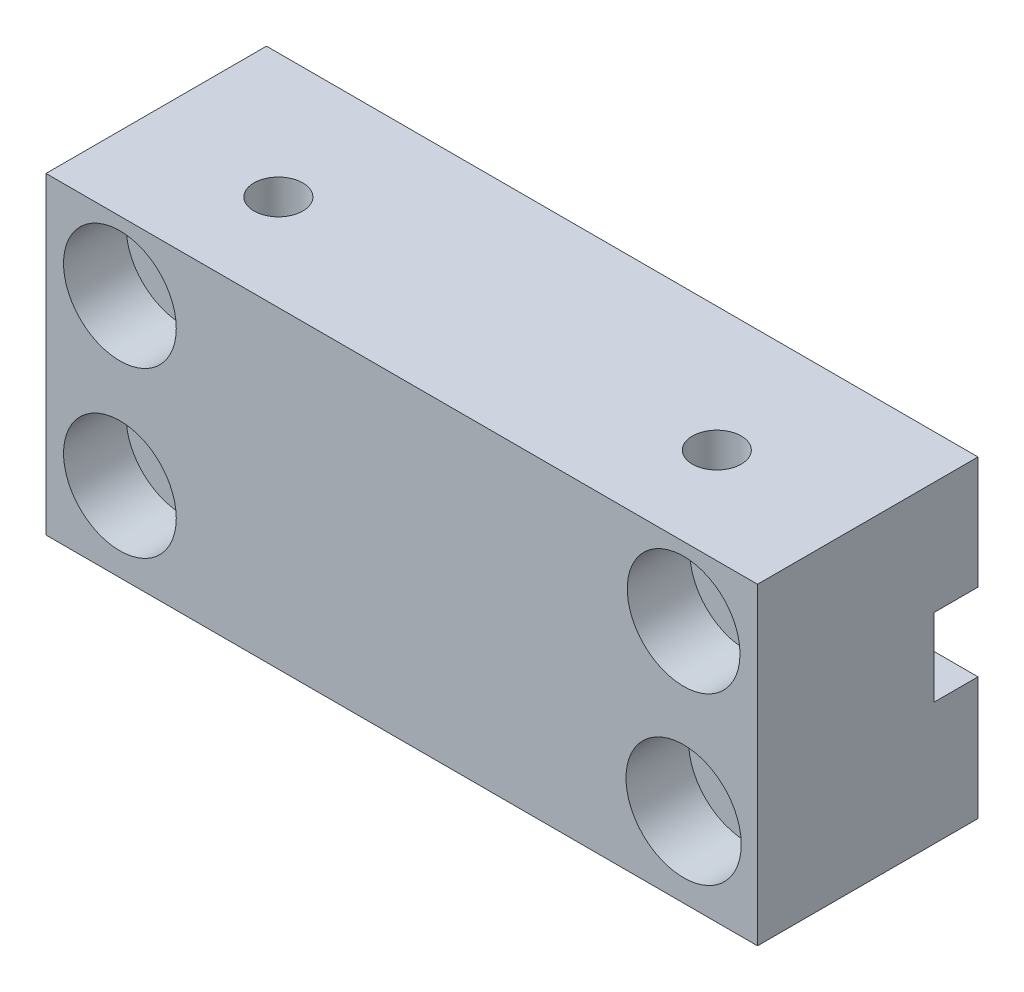
ISO-10303-21;
HEADER;
FILE_DESCRIPTION(('STEP AP214'),'2;1');
FILE_NAME('part.step','',(''),(''),'','','');
FILE_SCHEMA(('AUTOMOTIVE_DESIGN { 1 0 10303 214 1 1 1 1 }'));
ENDSEC;
DATA;
#1=APPLICATION_CONTEXT('core data for automotive mechanical design processes');
#2=APPLICATION_PROTOCOL_DEFINITION('international standard','automotive_design',2000,#1);
#3=PRODUCT_CONTEXT('',#1,'mechanical');
#4=PRODUCT('Part','Part','',(#3));
#5=PRODUCT_RELATED_PRODUCT_CATEGORY('part','',(#4));
#6=PRODUCT_DEFINITION_FORMATION('','',#4);
#7=PRODUCT_DEFINITION_CONTEXT('part definition',#1,'design');
#8=PRODUCT_DEFINITION('design','',#6,#7);
#9=PRODUCT_DEFINITION_SHAPE('','',#8);
#10=(LENGTH_UNIT() NAMED_UNIT(*) SI_UNIT(.MILLI.,.METRE.));
#11=(NAMED_UNIT(*) PLANE_ANGLE_UNIT() SI_UNIT($,.RADIAN.));
#12=(NAMED_UNIT(*) SI_UNIT($,.STERADIAN.) SOLID_ANGLE_UNIT());
#13=UNCERTAINTY_MEASURE_WITH_UNIT(LENGTH_MEASURE(1.E-05),#10,'distance_accuracy_value','');
#14=(GEOMETRIC_REPRESENTATION_CONTEXT(3) GLOBAL_UNCERTAINTY_ASSIGNED_CONTEXT((#13)) GLOBAL_UNIT_ASSIGNED_CONTEXT((#10,
#11,#12)) REPRESENTATION_CONTEXT('',''));
#15=CARTESIAN_POINT('',(0.,0.,0.));
#16=DIRECTION('',(0.,0.,1.));
#17=DIRECTION('',(1.,0.,0.));
#18=AXIS2_PLACEMENT_3D('',#15,#16,#17);
#19=CARTESIAN_POINT('',(0.,0.,0.));
#20=DIRECTION('',(0.,0.,1.));
#21=DIRECTION('',(1.,0.,0.));
#22=AXIS2_PLACEMENT_3D('',#19,#20,#21);
#23=PLANE('',#22);
#24=CARTESIAN_POINT('',(28.575,8.875537672255,0.));
#25=DIRECTION('',(0.,0.,1.));
#26=DIRECTION('',(1.,0.,0.));
#27=AXIS2_PLACEMENT_3D('',#24,#25,#26);
#28=CIRCLE('',#27,2.54);
#29=CARTESIAN_POINT('',(31.115,8.875537672255,0.));
#30=VERTEX_POINT('',#29);
#31=EDGE_CURVE('E227',#30,#30,#28,.T.);
#32=ORIENTED_EDGE('',*,*,#31,.T.);
#33=EDGE_LOOP('',(#32));
#34=FACE_BOUND('',#33,.T.);
#35=CARTESIAN_POINT('',(-28.575,8.875537672255,0.));
#36=DIRECTION('',(0.,0.,1.));
#37=DIRECTION('',(1.,0.,0.));
#38=AXIS2_PLACEMENT_3D('',#35,#36,#37);
#39=CIRCLE('',#38,2.54);
#40=CARTESIAN_POINT('',(-26.035,8.875537672255,0.));
#41=VERTEX_POINT('',#40);
#42=EDGE_CURVE('E239',#41,#41,#39,.T.);
#43=ORIENTED_EDGE('',*,*,#42,.T.);
#44=EDGE_LOOP('',(#43));
#45=FACE_BOUND('',#44,.T.);
#46=DIRECTION('',(0.,1.,0.));
#47=VECTOR('',#46,1.);
#48=CARTESIAN_POINT('',(36.068,15.875,0.));
#49=LINE('',#48,#47);
#50=CARTESIAN_POINT('',(36.068,4.445,0.));
#51=VERTEX_POINT('',#50);
#52=CARTESIAN_POINT('',(36.068,15.875,0.));
#53=VERTEX_POINT('',#52);
#54=EDGE_CURVE('E132',#51,#53,#49,.T.);
#55=ORIENTED_EDGE('',*,*,#54,.F.);
#56=DIRECTION('',(-1.,0.,0.));
#57=VECTOR('',#56,1.);
#58=CARTESIAN_POINT('',(36.068,4.445,0.));
#59=LINE('',#58,#57);
#60=CARTESIAN_POINT('',(-36.068,4.445,0.));
#61=VERTEX_POINT('',#60);
#62=EDGE_CURVE('E198',#51,#61,#59,.T.);
#63=ORIENTED_EDGE('',*,*,#62,.T.);
#64=DIRECTION('',(0.,-1.,0.));
#65=VECTOR('',#64,1.);
#66=CARTESIAN_POINT('',(-36.068,15.875,0.));
#67=LINE('',#66,#65);
#68=CARTESIAN_POINT('',(-36.068,15.875,0.));
#69=VERTEX_POINT('',#68);
#70=EDGE_CURVE('E139',#69,#61,#67,.T.);
#71=ORIENTED_EDGE('',*,*,#70,.F.);
#72=DIRECTION('',(-1.,0.,0.));
#73=VECTOR('',#72,1.);
#74=CARTESIAN_POINT('',(-36.068,15.875,0.));
#75=LINE('',#74,#73);
#76=EDGE_CURVE('E131',#53,#69,#75,.T.);
#77=ORIENTED_EDGE('',*,*,#76,.F.);
#78=EDGE_LOOP('',(#55,#63,#71,#77));
#79=FACE_BOUND('',#78,.T.);
#80=ADVANCED_FACE('F36',(#34,#45,#79),#23,.F.);
#81=CARTESIAN_POINT('',(0.,0.,22.352));
#82=DIRECTION('',(0.,0.,1.));
#83=DIRECTION('',(1.,0.,0.));
#84=AXIS2_PLACEMENT_3D('',#81,#82,#83);
#85=PLANE('',#84);
#86=CARTESIAN_POINT('',(28.575,-7.80025949957298,22.352));
#87=DIRECTION('',(0.,0.,1.));
#88=DIRECTION('',(1.,0.,0.));
#89=AXIS2_PLACEMENT_3D('',#86,#87,#88);
#90=CIRCLE('',#89,5.842);
#91=CARTESIAN_POINT('',(34.417,-7.80025949957298,22.352));
#92=VERTEX_POINT('',#91);
#93=EDGE_CURVE('E172',#92,#92,#90,.T.);
#94=ORIENTED_EDGE('',*,*,#93,.F.);
#95=EDGE_LOOP('',(#94));
#96=FACE_BOUND('',#95,.T.);
#97=CARTESIAN_POINT('',(-28.575,8.875537672255,22.352));
#98=DIRECTION('',(0.,0.,1.));
#99=DIRECTION('',(1.,0.,0.));
#100=AXIS2_PLACEMENT_3D('',#97,#98,#99);
#101=CIRCLE('',#100,5.715);
#102=CARTESIAN_POINT('',(-22.86,8.875537672255,22.352));
#103=VERTEX_POINT('',#102);
#104=EDGE_CURVE('E135',#103,#103,#101,.T.);
#105=ORIENTED_EDGE('',*,*,#104,.F.);
#106=EDGE_LOOP('',(#105));
#107=FACE_BOUND('',#106,.T.);
#108=DIRECTION('',(0.,1.,0.));
#109=VECTOR('',#108,1.);
#110=CARTESIAN_POINT('',(36.068,15.875,22.352));
#111=LINE('',#110,#109);
#112=CARTESIAN_POINT('',(36.068,-15.875,22.352));
#113=VERTEX_POINT('',#112);
#114=CARTESIAN_POINT('',(36.068,15.875,22.352));
#115=VERTEX_POINT('',#114);
#116=EDGE_CURVE('E143',#113,#115,#111,.T.);
#117=ORIENTED_EDGE('',*,*,#116,.T.);
#118=DIRECTION('',(-1.,0.,0.));
#119=VECTOR('',#118,1.);
#120=CARTESIAN_POINT('',(-36.068,15.875,22.352));
#121=LINE('',#120,#119);
#122=CARTESIAN_POINT('',(-36.068,15.875,22.352));
#123=VERTEX_POINT('',#122);
#124=EDGE_CURVE('E89',#115,#123,#121,.T.);
#125=ORIENTED_EDGE('',*,*,#124,.T.);
#126=DIRECTION('',(0.,-1.,0.));
#127=VECTOR('',#126,1.);
#128=CARTESIAN_POINT('',(-36.068,15.875,22.352));
#129=LINE('',#128,#127);
#130=CARTESIAN_POINT('',(-36.068,-15.875,22.352));
#131=VERTEX_POINT('',#130);
#132=EDGE_CURVE('E182',#123,#131,#129,.T.);
#133=ORIENTED_EDGE('',*,*,#132,.T.);
#134=DIRECTION('',(1.,0.,0.));
#135=VECTOR('',#134,1.);
#136=CARTESIAN_POINT('',(-36.068,-15.875,22.352));
#137=LINE('',#136,#135);
#138=EDGE_CURVE('E60',#131,#113,#137,.T.);
#139=ORIENTED_EDGE('',*,*,#138,.T.);
#140=EDGE_LOOP('',(#117,#125,#133,#139));
#141=FACE_BOUND('',#140,.T.);
#142=CARTESIAN_POINT('',(28.575,8.875537672255,22.352));
#143=DIRECTION('',(0.,0.,1.));
#144=DIRECTION('',(1.,0.,0.));
#145=AXIS2_PLACEMENT_3D('',#142,#143,#144);
#146=CIRCLE('',#145,5.715);
#147=CARTESIAN_POINT('',(34.29,8.875537672255,22.352));
#148=VERTEX_POINT('',#147);
#149=EDGE_CURVE('E170',#148,#148,#146,.T.);
#150=ORIENTED_EDGE('',*,*,#149,.F.);
#151=EDGE_LOOP('',(#150));
#152=FACE_BOUND('',#151,.T.);
#153=CARTESIAN_POINT('',(-28.575,-7.80025949957298,22.352));
#154=DIRECTION('',(0.,0.,1.));
#155=DIRECTION('',(1.,0.,0.));
#156=AXIS2_PLACEMENT_3D('',#153,#154,#155);
#157=CIRCLE('',#156,5.715);
#158=CARTESIAN_POINT('',(-22.86,-7.80025949957298,22.352));
#159=VERTEX_POINT('',#158);
#160=EDGE_CURVE('E177',#159,#159,#157,.T.);
#161=ORIENTED_EDGE('',*,*,#160,.F.);
#162=EDGE_LOOP('',(#161));
#163=FACE_BOUND('',#162,.T.);
#164=ADVANCED_FACE('F185',(#96,#107,#141,#152,#163),#85,.T.);
#165=CARTESIAN_POINT('',(-36.068,-3.429,0.));
#166=VERTEX_POINT('',#165);
#167=CARTESIAN_POINT('',(-36.068,-15.875,0.));
#168=VERTEX_POINT('',#167);
#169=EDGE_CURVE('E126',#166,#168,#67,.T.);
#170=ORIENTED_EDGE('',*,*,#169,.F.);
#171=DIRECTION('',(-1.,0.,0.));
#172=VECTOR('',#171,1.);
#173=CARTESIAN_POINT('',(36.068,-3.429,0.));
#174=LINE('',#173,#172);
#175=CARTESIAN_POINT('',(36.068,-3.429,0.));
#176=VERTEX_POINT('',#175);
#177=EDGE_CURVE('E51',#176,#166,#174,.T.);
#178=ORIENTED_EDGE('',*,*,#177,.F.);
#179=CARTESIAN_POINT('',(36.068,-15.875,0.));
#180=VERTEX_POINT('',#179);
#181=EDGE_CURVE('E125',#180,#176,#49,.T.);
#182=ORIENTED_EDGE('',*,*,#181,.F.);
#183=DIRECTION('',(1.,0.,0.));
#184=VECTOR('',#183,1.);
#185=CARTESIAN_POINT('',(-36.068,-15.875,0.));
#186=LINE('',#185,#184);
#187=EDGE_CURVE('E81',#168,#180,#186,.T.);
#188=ORIENTED_EDGE('',*,*,#187,.F.);
#189=EDGE_LOOP('',(#170,#178,#182,#188));
#190=FACE_BOUND('',#189,.T.);
#191=CARTESIAN_POINT('',(-28.575,-7.80025949957298,0.));
#192=DIRECTION('',(0.,0.,1.));
#193=DIRECTION('',(1.,0.,0.));
#194=AXIS2_PLACEMENT_3D('',#191,#192,#193);
#195=CIRCLE('',#194,2.54);
#196=CARTESIAN_POINT('',(-26.035,-7.80025949957298,0.));
#197=VERTEX_POINT('',#196);
#198=EDGE_CURVE('E233',#197,#197,#195,.T.);
#199=ORIENTED_EDGE('',*,*,#198,.T.);
#200=EDGE_LOOP('',(#199));
#201=FACE_BOUND('',#200,.T.);
#202=CARTESIAN_POINT('',(28.575,-7.80025949957298,0.));
#203=DIRECTION('',(0.,0.,1.));
#204=DIRECTION('',(1.,0.,0.));
#205=AXIS2_PLACEMENT_3D('',#202,#203,#204);
#206=CIRCLE('',#205,2.54);
#207=CARTESIAN_POINT('',(31.115,-7.80025949957298,0.));
#208=VERTEX_POINT('',#207);
#209=EDGE_CURVE('E221',#208,#208,#206,.T.);
#210=ORIENTED_EDGE('',*,*,#209,.T.);
#211=EDGE_LOOP('',(#210));
#212=FACE_BOUND('',#211,.T.);
#213=ADVANCED_FACE('F123',(#190,#201,#212),#23,.F.);
#214=CARTESIAN_POINT('',(36.068,15.875,22.352));
#215=DIRECTION('',(-1.,0.,0.));
#216=DIRECTION('',(0.,-1.,0.));
#217=AXIS2_PLACEMENT_3D('',#214,#215,#216);
#218=PLANE('',#217);
#219=DIRECTION('',(0.,1.,0.));
#220=VECTOR('',#219,1.);
#221=CARTESIAN_POINT('',(36.068,4.445,4.445));
#222=LINE('',#221,#220);
#223=CARTESIAN_POINT('',(36.068,-3.429,4.445));
#224=VERTEX_POINT('',#223);
#225=CARTESIAN_POINT('',(36.068,4.445,4.445));
#226=VERTEX_POINT('',#225);
#227=EDGE_CURVE('E117',#224,#226,#222,.T.);
#228=ORIENTED_EDGE('',*,*,#227,.T.);
#229=DIRECTION('',(0.,0.,-1.));
#230=VECTOR('',#229,1.);
#231=CARTESIAN_POINT('',(36.068,4.445,0.));
#232=LINE('',#231,#230);
#233=EDGE_CURVE('E127',#226,#51,#232,.T.);
#234=ORIENTED_EDGE('',*,*,#233,.T.);
#235=ORIENTED_EDGE('',*,*,#54,.T.);
#236=DIRECTION('',(0.,0.,-1.));
#237=VECTOR('',#236,1.);
#238=CARTESIAN_POINT('',(36.068,15.875,22.352));
#239=LINE('',#238,#237);
#240=EDGE_CURVE('E150',#115,#53,#239,.T.);
#241=ORIENTED_EDGE('',*,*,#240,.F.);
#242=ORIENTED_EDGE('',*,*,#116,.F.);
#243=DIRECTION('',(0.,0.,-1.));
#244=VECTOR('',#243,1.);
#245=CARTESIAN_POINT('',(36.068,-15.875,22.352));
#246=LINE('',#245,#244);
#247=EDGE_CURVE('E130',#113,#180,#246,.T.);
#248=ORIENTED_EDGE('',*,*,#247,.T.);
#249=ORIENTED_EDGE('',*,*,#181,.T.);
#250=DIRECTION('',(0.,0.,1.));
#251=VECTOR('',#250,1.);
#252=CARTESIAN_POINT('',(36.068,-3.429,0.));
#253=LINE('',#252,#251);
#254=EDGE_CURVE('E110',#176,#224,#253,.T.);
#255=ORIENTED_EDGE('',*,*,#254,.T.);
#256=EDGE_LOOP('',(#228,#234,#235,#241,#242,#248,#249,#255));
#257=FACE_BOUND('',#256,.T.);
#258=ADVANCED_FACE('F38',(#257),#218,.F.);
#259=CARTESIAN_POINT('',(-36.068,15.875,22.352));
#260=DIRECTION('',(0.,-1.,0.));
#261=DIRECTION('',(0.,0.,-1.));
#262=AXIS2_PLACEMENT_3D('',#259,#260,#261);
#263=PLANE('',#262);
#264=CARTESIAN_POINT('',(-22.225,15.875,12.6365));
#265=DIRECTION('',(0.,-1.,0.));
#266=DIRECTION('',(0.,0.,-1.));
#267=AXIS2_PLACEMENT_3D('',#264,#265,#266);
#268=CIRCLE('',#267,2.4765);
#269=CARTESIAN_POINT('',(-22.225,15.875,10.16));
#270=VERTEX_POINT('',#269);
#271=EDGE_CURVE('E212',#270,#270,#268,.T.);
#272=ORIENTED_EDGE('',*,*,#271,.T.);
#273=EDGE_LOOP('',(#272));
#274=FACE_BOUND('',#273,.T.);
#275=CARTESIAN_POINT('',(22.225,15.875,12.6365));
#276=DIRECTION('',(0.,-1.,0.));
#277=DIRECTION('',(0.,0.,-1.));
#278=AXIS2_PLACEMENT_3D('',#275,#276,#277);
#279=CIRCLE('',#278,2.4765);
#280=CARTESIAN_POINT('',(22.225,15.875,10.16));
#281=VERTEX_POINT('',#280);
#282=EDGE_CURVE('E205',#281,#281,#279,.T.);
#283=ORIENTED_EDGE('',*,*,#282,.T.);
#284=EDGE_LOOP('',(#283));
#285=FACE_BOUND('',#284,.T.);
#286=ORIENTED_EDGE('',*,*,#76,.T.);
#287=DIRECTION('',(0.,0.,-1.));
#288=VECTOR('',#287,1.);
#289=CARTESIAN_POINT('',(-36.068,15.875,22.352));
#290=LINE('',#289,#288);
#291=EDGE_CURVE('E147',#123,#69,#290,.T.);
#292=ORIENTED_EDGE('',*,*,#291,.F.);
#293=ORIENTED_EDGE('',*,*,#124,.F.);
#294=ORIENTED_EDGE('',*,*,#240,.T.);
#295=EDGE_LOOP('',(#286,#292,#293,#294));
#296=FACE_BOUND('',#295,.T.);
#297=ADVANCED_FACE('F193',(#274,#285,#296),#263,.F.);
#298=CARTESIAN_POINT('',(-36.068,15.875,22.352));
#299=DIRECTION('',(1.,0.,0.));
#300=DIRECTION('',(0.,0.,-1.));
#301=AXIS2_PLACEMENT_3D('',#298,#299,#300);
#302=PLANE('',#301);
#303=ORIENTED_EDGE('',*,*,#70,.T.);
#304=DIRECTION('',(0.,0.,-1.));
#305=VECTOR('',#304,1.);
#306=CARTESIAN_POINT('',(-36.068,4.445,0.));
#307=LINE('',#306,#305);
#308=CARTESIAN_POINT('',(-36.068,4.445,4.445));
#309=VERTEX_POINT('',#308);
#310=EDGE_CURVE('E118',#309,#61,#307,.T.);
#311=ORIENTED_EDGE('',*,*,#310,.F.);
#312=DIRECTION('',(0.,1.,0.));
#313=VECTOR('',#312,1.);
#314=CARTESIAN_POINT('',(-36.068,4.445,4.445));
#315=LINE('',#314,#313);
#316=CARTESIAN_POINT('',(-36.068,-3.429,4.445));
#317=VERTEX_POINT('',#316);
#318=EDGE_CURVE('E455',#317,#309,#315,.T.);
#319=ORIENTED_EDGE('',*,*,#318,.F.);
#320=DIRECTION('',(0.,0.,1.));
#321=VECTOR('',#320,1.);
#322=CARTESIAN_POINT('',(-36.068,-3.429,0.));
#323=LINE('',#322,#321);
#324=EDGE_CURVE('E456',#166,#317,#323,.T.);
#325=ORIENTED_EDGE('',*,*,#324,.F.);
#326=ORIENTED_EDGE('',*,*,#169,.T.);
#327=DIRECTION('',(0.,0.,-1.));
#328=VECTOR('',#327,1.);
#329=CARTESIAN_POINT('',(-36.068,-15.875,22.352));
#330=LINE('',#329,#328);
#331=EDGE_CURVE('E145',#131,#168,#330,.T.);
#332=ORIENTED_EDGE('',*,*,#331,.F.);
#333=ORIENTED_EDGE('',*,*,#132,.F.);
#334=ORIENTED_EDGE('',*,*,#291,.T.);
#335=EDGE_LOOP('',(#303,#311,#319,#325,#326,#332,#333,#334));
#336=FACE_BOUND('',#335,.T.);
#337=ADVANCED_FACE('F187',(#336),#302,.F.);
#338=CARTESIAN_POINT('',(-36.068,-15.875,22.352));
#339=DIRECTION('',(0.,1.,0.));
#340=DIRECTION('',(0.,0.,1.));
#341=AXIS2_PLACEMENT_3D('',#338,#339,#340);
#342=PLANE('',#341);
#343=CARTESIAN_POINT('',(-22.225,-15.875,12.6365));
#344=DIRECTION('',(0.,-1.,0.));
#345=DIRECTION('',(0.,0.,-1.));
#346=AXIS2_PLACEMENT_3D('',#343,#344,#345);
#347=CIRCLE('',#346,2.4765);
#348=CARTESIAN_POINT('',(-22.225,-15.875,10.16));
#349=VERTEX_POINT('',#348);
#350=EDGE_CURVE('E216',#349,#349,#347,.T.);
#351=ORIENTED_EDGE('',*,*,#350,.F.);
#352=EDGE_LOOP('',(#351));
#353=FACE_BOUND('',#352,.T.);
#354=CARTESIAN_POINT('',(22.225,-15.875,12.6365));
#355=DIRECTION('',(0.,-1.,0.));
#356=DIRECTION('',(0.,0.,-1.));
#357=AXIS2_PLACEMENT_3D('',#354,#355,#356);
#358=CIRCLE('',#357,2.4765);
#359=CARTESIAN_POINT('',(22.225,-15.875,10.16));
#360=VERTEX_POINT('',#359);
#361=EDGE_CURVE('E201',#360,#360,#358,.T.);
#362=ORIENTED_EDGE('',*,*,#361,.F.);
#363=EDGE_LOOP('',(#362));
#364=FACE_BOUND('',#363,.T.);
#365=ORIENTED_EDGE('',*,*,#187,.T.);
#366=ORIENTED_EDGE('',*,*,#247,.F.);
#367=ORIENTED_EDGE('',*,*,#138,.F.);
#368=ORIENTED_EDGE('',*,*,#331,.T.);
#369=EDGE_LOOP('',(#365,#366,#367,#368));
#370=FACE_BOUND('',#369,.T.);
#371=ADVANCED_FACE('F188',(#353,#364,#370),#342,.F.);
#372=CARTESIAN_POINT('',(-28.575,8.875537672255,22.352));
#373=DIRECTION('',(0.,0.,-1.));
#374=DIRECTION('',(-1.,0.,0.));
#375=AXIS2_PLACEMENT_3D('',#372,#373,#374);
#376=CYLINDRICAL_SURFACE('',#375,5.715);
#377=CARTESIAN_POINT('',(-28.575,8.875537672255,16.002));
#378=DIRECTION('',(0.,0.,1.));
#379=DIRECTION('',(1.,0.,0.));
#380=AXIS2_PLACEMENT_3D('',#377,#378,#379);
#381=CIRCLE('',#380,5.715);
#382=CARTESIAN_POINT('',(-22.86,8.875537672255,16.002));
#383=VERTEX_POINT('',#382);
#384=EDGE_CURVE('E152',#383,#383,#381,.T.);
#385=ORIENTED_EDGE('',*,*,#384,.F.);
#386=EDGE_LOOP('',(#385));
#387=FACE_BOUND('',#386,.T.);
#388=ORIENTED_EDGE('',*,*,#104,.T.);
#389=EDGE_LOOP('',(#388));
#390=FACE_BOUND('',#389,.T.);
#391=ADVANCED_FACE('F166',(#387,#390),#376,.F.);
#392=CARTESIAN_POINT('',(28.575,8.875537672255,22.352));
#393=DIRECTION('',(0.,0.,-1.));
#394=DIRECTION('',(-1.,0.,0.));
#395=AXIS2_PLACEMENT_3D('',#392,#393,#394);
#396=CYLINDRICAL_SURFACE('',#395,5.715);
#397=CARTESIAN_POINT('',(28.575,8.875537672255,16.002));
#398=DIRECTION('',(0.,0.,1.));
#399=DIRECTION('',(1.,0.,0.));
#400=AXIS2_PLACEMENT_3D('',#397,#398,#399);
#401=CIRCLE('',#400,5.715);
#402=CARTESIAN_POINT('',(34.29,8.875537672255,16.002));
#403=VERTEX_POINT('',#402);
#404=EDGE_CURVE('E44',#403,#403,#401,.T.);
#405=ORIENTED_EDGE('',*,*,#404,.F.);
#406=EDGE_LOOP('',(#405));
#407=FACE_BOUND('',#406,.T.);
#408=ORIENTED_EDGE('',*,*,#149,.T.);
#409=EDGE_LOOP('',(#408));
#410=FACE_BOUND('',#409,.T.);
#411=ADVANCED_FACE('F162',(#407,#410),#396,.F.);
#412=CARTESIAN_POINT('',(28.575,-7.80025949957298,22.352));
#413=DIRECTION('',(0.,0.,-1.));
#414=DIRECTION('',(-1.,0.,0.));
#415=AXIS2_PLACEMENT_3D('',#412,#413,#414);
#416=CYLINDRICAL_SURFACE('',#415,5.842);
#417=CARTESIAN_POINT('',(28.575,-7.80025949957298,16.002));
#418=DIRECTION('',(0.,0.,1.));
#419=DIRECTION('',(1.,0.,0.));
#420=AXIS2_PLACEMENT_3D('',#417,#418,#419);
#421=CIRCLE('',#420,5.842);
#422=CARTESIAN_POINT('',(34.417,-7.80025949957298,16.002));
#423=VERTEX_POINT('',#422);
#424=EDGE_CURVE('E12',#423,#423,#421,.T.);
#425=ORIENTED_EDGE('',*,*,#424,.F.);
#426=EDGE_LOOP('',(#425));
#427=FACE_BOUND('',#426,.T.);
#428=ORIENTED_EDGE('',*,*,#93,.T.);
#429=EDGE_LOOP('',(#428));
#430=FACE_BOUND('',#429,.T.);
#431=ADVANCED_FACE('F165',(#427,#430),#416,.F.);
#432=CARTESIAN_POINT('',(-28.575,-7.80025949957298,22.352));
#433=DIRECTION('',(0.,0.,-1.));
#434=DIRECTION('',(-1.,0.,0.));
#435=AXIS2_PLACEMENT_3D('',#432,#433,#434);
#436=CYLINDRICAL_SURFACE('',#435,5.715);
#437=CARTESIAN_POINT('',(-28.575,-7.80025949957298,16.002));
#438=DIRECTION('',(0.,0.,1.));
#439=DIRECTION('',(1.,0.,0.));
#440=AXIS2_PLACEMENT_3D('',#437,#438,#439);
#441=CIRCLE('',#440,5.715);
#442=CARTESIAN_POINT('',(-22.86,-7.80025949957298,16.002));
#443=VERTEX_POINT('',#442);
#444=EDGE_CURVE('E155',#443,#443,#441,.T.);
#445=ORIENTED_EDGE('',*,*,#444,.F.);
#446=EDGE_LOOP('',(#445));
#447=FACE_BOUND('',#446,.T.);
#448=ORIENTED_EDGE('',*,*,#160,.T.);
#449=EDGE_LOOP('',(#448));
#450=FACE_BOUND('',#449,.T.);
#451=ADVANCED_FACE('F246',(#447,#450),#436,.F.);
#452=CARTESIAN_POINT('',(-28.575,8.875537672255,38.8756712627673));
#453=DIRECTION('',(0.,0.,-1.));
#454=DIRECTION('',(-1.,0.,0.));
#455=AXIS2_PLACEMENT_3D('',#452,#453,#454);
#456=CYLINDRICAL_SURFACE('',#455,2.54);
#457=ORIENTED_EDGE('',*,*,#42,.F.);
#458=EDGE_LOOP('',(#457));
#459=FACE_BOUND('',#458,.T.);
#460=CARTESIAN_POINT('',(-28.575,8.875537672255,16.002));
#461=DIRECTION('',(0.,0.,1.));
#462=DIRECTION('',(1.,0.,0.));
#463=AXIS2_PLACEMENT_3D('',#460,#461,#462);
#464=CIRCLE('',#463,2.54);
#465=CARTESIAN_POINT('',(-26.035,8.875537672255,16.002));
#466=VERTEX_POINT('',#465);
#467=EDGE_CURVE('E236',#466,#466,#464,.T.);
#468=ORIENTED_EDGE('',*,*,#467,.T.);
#469=EDGE_LOOP('',(#468));
#470=FACE_BOUND('',#469,.T.);
#471=ADVANCED_FACE('F315',(#459,#470),#456,.F.);
#472=CARTESIAN_POINT('',(0.,0.,16.002));
#473=DIRECTION('',(0.,0.,1.));
#474=DIRECTION('',(1.,0.,0.));
#475=AXIS2_PLACEMENT_3D('',#472,#473,#474);
#476=PLANE('',#475);
#477=ORIENTED_EDGE('',*,*,#467,.F.);
#478=EDGE_LOOP('',(#477));
#479=FACE_BOUND('',#478,.T.);
#480=ORIENTED_EDGE('',*,*,#384,.T.);
#481=EDGE_LOOP('',(#480));
#482=FACE_BOUND('',#481,.T.);
#483=ADVANCED_FACE('F311',(#479,#482),#476,.T.);
#484=CARTESIAN_POINT('',(-28.575,-7.80025949957298,38.8756712627673));
#485=DIRECTION('',(0.,0.,-1.));
#486=DIRECTION('',(-1.,0.,0.));
#487=AXIS2_PLACEMENT_3D('',#484,#485,#486);
#488=CYLINDRICAL_SURFACE('',#487,2.54);
#489=ORIENTED_EDGE('',*,*,#198,.F.);
#490=EDGE_LOOP('',(#489));
#491=FACE_BOUND('',#490,.T.);
#492=CARTESIAN_POINT('',(-28.575,-7.80025949957298,16.002));
#493=DIRECTION('',(0.,0.,1.));
#494=DIRECTION('',(1.,0.,0.));
#495=AXIS2_PLACEMENT_3D('',#492,#493,#494);
#496=CIRCLE('',#495,2.54);
#497=CARTESIAN_POINT('',(-26.035,-7.80025949957298,16.002));
#498=VERTEX_POINT('',#497);
#499=EDGE_CURVE('E230',#498,#498,#496,.T.);
#500=ORIENTED_EDGE('',*,*,#499,.T.);
#501=EDGE_LOOP('',(#500));
#502=FACE_BOUND('',#501,.T.);
#503=ADVANCED_FACE('F307',(#491,#502),#488,.F.);
#504=CARTESIAN_POINT('',(0.,0.,16.002));
#505=DIRECTION('',(0.,0.,1.));
#506=DIRECTION('',(1.,0.,0.));
#507=AXIS2_PLACEMENT_3D('',#504,#505,#506);
#508=PLANE('',#507);
#509=ORIENTED_EDGE('',*,*,#499,.F.);
#510=EDGE_LOOP('',(#509));
#511=FACE_BOUND('',#510,.T.);
#512=ORIENTED_EDGE('',*,*,#444,.T.);
#513=EDGE_LOOP('',(#512));
#514=FACE_BOUND('',#513,.T.);
#515=ADVANCED_FACE('F303',(#511,#514),#508,.T.);
#516=CARTESIAN_POINT('',(28.575,8.875537672255,38.8756712627673));
#517=DIRECTION('',(0.,0.,-1.));
#518=DIRECTION('',(-1.,0.,0.));
#519=AXIS2_PLACEMENT_3D('',#516,#517,#518);
#520=CYLINDRICAL_SURFACE('',#519,2.54);
#521=ORIENTED_EDGE('',*,*,#31,.F.);
#522=EDGE_LOOP('',(#521));
#523=FACE_BOUND('',#522,.T.);
#524=CARTESIAN_POINT('',(28.575,8.875537672255,16.002));
#525=DIRECTION('',(0.,0.,1.));
#526=DIRECTION('',(1.,0.,0.));
#527=AXIS2_PLACEMENT_3D('',#524,#525,#526);
#528=CIRCLE('',#527,2.54);
#529=CARTESIAN_POINT('',(31.115,8.875537672255,16.002));
#530=VERTEX_POINT('',#529);
#531=EDGE_CURVE('E224',#530,#530,#528,.T.);
#532=ORIENTED_EDGE('',*,*,#531,.T.);
#533=EDGE_LOOP('',(#532));
#534=FACE_BOUND('',#533,.T.);
#535=ADVANCED_FACE('F299',(#523,#534),#520,.F.);
#536=CARTESIAN_POINT('',(0.,0.,16.002));
#537=DIRECTION('',(0.,0.,1.));
#538=DIRECTION('',(1.,0.,0.));
#539=AXIS2_PLACEMENT_3D('',#536,#537,#538);
#540=PLANE('',#539);
#541=ORIENTED_EDGE('',*,*,#531,.F.);
#542=EDGE_LOOP('',(#541));
#543=FACE_BOUND('',#542,.T.);
#544=ORIENTED_EDGE('',*,*,#404,.T.);
#545=EDGE_LOOP('',(#544));
#546=FACE_BOUND('',#545,.T.);
#547=ADVANCED_FACE('F160',(#543,#546),#540,.T.);
#548=CARTESIAN_POINT('',(28.575,-7.80025949957298,38.8756712627673));
#549=DIRECTION('',(0.,0.,-1.));
#550=DIRECTION('',(-1.,0.,0.));
#551=AXIS2_PLACEMENT_3D('',#548,#549,#550);
#552=CYLINDRICAL_SURFACE('',#551,2.54);
#553=ORIENTED_EDGE('',*,*,#209,.F.);
#554=EDGE_LOOP('',(#553));
#555=FACE_BOUND('',#554,.T.);
#556=CARTESIAN_POINT('',(28.575,-7.80025949957298,16.002));
#557=DIRECTION('',(0.,0.,1.));
#558=DIRECTION('',(1.,0.,0.));
#559=AXIS2_PLACEMENT_3D('',#556,#557,#558);
#560=CIRCLE('',#559,2.54);
#561=CARTESIAN_POINT('',(31.115,-7.80025949957298,16.002));
#562=VERTEX_POINT('',#561);
#563=EDGE_CURVE('E215',#562,#562,#560,.T.);
#564=ORIENTED_EDGE('',*,*,#563,.T.);
#565=EDGE_LOOP('',(#564));
#566=FACE_BOUND('',#565,.T.);
#567=ADVANCED_FACE('F289',(#555,#566),#552,.F.);
#568=CARTESIAN_POINT('',(0.,0.,16.002));
#569=DIRECTION('',(0.,0.,1.));
#570=DIRECTION('',(1.,0.,0.));
#571=AXIS2_PLACEMENT_3D('',#568,#569,#570);
#572=PLANE('',#571);
#573=ORIENTED_EDGE('',*,*,#563,.F.);
#574=EDGE_LOOP('',(#573));
#575=FACE_BOUND('',#574,.T.);
#576=ORIENTED_EDGE('',*,*,#424,.T.);
#577=EDGE_LOOP('',(#576));
#578=FACE_BOUND('',#577,.T.);
#579=ADVANCED_FACE('F278',(#575,#578),#572,.T.);
#580=CARTESIAN_POINT('',(22.225,15.875,12.6365));
#581=DIRECTION('',(0.,-1.,0.));
#582=DIRECTION('',(0.,0.,-1.));
#583=AXIS2_PLACEMENT_3D('',#580,#581,#582);
#584=CYLINDRICAL_SURFACE('',#583,2.4765);
#585=ORIENTED_EDGE('',*,*,#282,.F.);
#586=EDGE_LOOP('',(#585));
#587=FACE_BOUND('',#586,.T.);
#588=ORIENTED_EDGE('',*,*,#361,.T.);
#589=EDGE_LOOP('',(#588));
#590=FACE_BOUND('',#589,.T.);
#591=ADVANCED_FACE('F274',(#587,#590),#584,.F.);
#592=CARTESIAN_POINT('',(-22.225,15.875,12.6365));
#593=DIRECTION('',(0.,-1.,0.));
#594=DIRECTION('',(0.,0.,-1.));
#595=AXIS2_PLACEMENT_3D('',#592,#593,#594);
#596=CYLINDRICAL_SURFACE('',#595,2.4765);
#597=ORIENTED_EDGE('',*,*,#271,.F.);
#598=EDGE_LOOP('',(#597));
#599=FACE_BOUND('',#598,.T.);
#600=ORIENTED_EDGE('',*,*,#350,.T.);
#601=EDGE_LOOP('',(#600));
#602=FACE_BOUND('',#601,.T.);
#603=ADVANCED_FACE('F277',(#599,#602),#596,.F.);
#604=CARTESIAN_POINT('',(36.068,4.445,0.));
#605=DIRECTION('',(0.,1.,0.));
#606=DIRECTION('',(0.,0.,1.));
#607=AXIS2_PLACEMENT_3D('',#604,#605,#606);
#608=PLANE('',#607);
#609=ORIENTED_EDGE('',*,*,#310,.T.);
#610=ORIENTED_EDGE('',*,*,#62,.F.);
#611=ORIENTED_EDGE('',*,*,#233,.F.);
#612=DIRECTION('',(-1.,0.,0.));
#613=VECTOR('',#612,1.);
#614=CARTESIAN_POINT('',(36.068,4.445,4.445));
#615=LINE('',#614,#613);
#616=EDGE_CURVE('E202',#226,#309,#615,.T.);
#617=ORIENTED_EDGE('',*,*,#616,.T.);
#618=EDGE_LOOP('',(#609,#610,#611,#617));
#619=FACE_BOUND('',#618,.T.);
#620=ADVANCED_FACE('F286',(#619),#608,.F.);
#621=CARTESIAN_POINT('',(36.068,4.445,4.445));
#622=DIRECTION('',(0.,0.,1.));
#623=DIRECTION('',(0.,-1.,0.));
#624=AXIS2_PLACEMENT_3D('',#621,#622,#623);
#625=PLANE('',#624);
#626=ORIENTED_EDGE('',*,*,#318,.T.);
#627=ORIENTED_EDGE('',*,*,#616,.F.);
#628=ORIENTED_EDGE('',*,*,#227,.F.);
#629=DIRECTION('',(-1.,0.,0.));
#630=VECTOR('',#629,1.);
#631=CARTESIAN_POINT('',(36.068,-3.429,4.445));
#632=LINE('',#631,#630);
#633=EDGE_CURVE('E112',#224,#317,#632,.T.);
#634=ORIENTED_EDGE('',*,*,#633,.T.);
#635=EDGE_LOOP('',(#626,#627,#628,#634));
#636=FACE_BOUND('',#635,.T.);
#637=ADVANCED_FACE('F433',(#636),#625,.F.);
#638=CARTESIAN_POINT('',(36.068,-3.429,0.));
#639=DIRECTION('',(0.,-1.,0.));
#640=DIRECTION('',(0.,0.,-1.));
#641=AXIS2_PLACEMENT_3D('',#638,#639,#640);
#642=PLANE('',#641);
#643=ORIENTED_EDGE('',*,*,#324,.T.);
#644=ORIENTED_EDGE('',*,*,#633,.F.);
#645=ORIENTED_EDGE('',*,*,#254,.F.);
#646=ORIENTED_EDGE('',*,*,#177,.T.);
#647=EDGE_LOOP('',(#643,#644,#645,#646));
#648=FACE_BOUND('',#647,.T.);
#649=ADVANCED_FACE('F111',(#648),#642,.F.);
#650=CLOSED_SHELL('',(#80,#164,#213,#258,#297,#337,#371,#391,#411,#431,#451,#471,#483,#503,#515,
#535,#547,#567,#579,#591,#603,#620,#637,#649));
#651=MANIFOLD_SOLID_BREP('B2',#650);
#652=ADVANCED_BREP_SHAPE_REPRESENTATION('',(#18,#651),#14);
#653=SHAPE_DEFINITION_REPRESENTATION(#9,#652);
ENDSEC;
END-ISO-10303-21;
